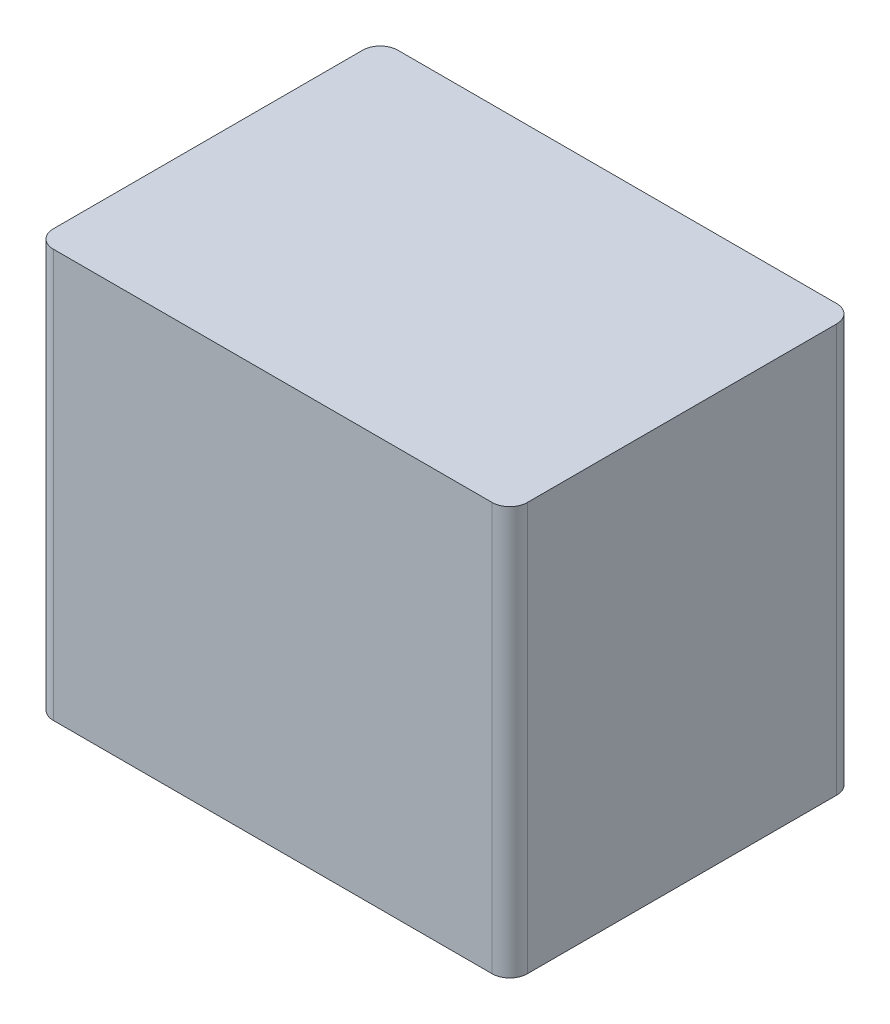
ISO-10303-21;
HEADER;
FILE_DESCRIPTION(('STEP AP214'),'2;1');
FILE_NAME('part.step','',(''),(''),'','','');
FILE_SCHEMA(('AUTOMOTIVE_DESIGN { 1 0 10303 214 1 1 1 1 }'));
ENDSEC;
DATA;
#1=APPLICATION_CONTEXT('core data for automotive mechanical design processes');
#2=APPLICATION_PROTOCOL_DEFINITION('international standard','automotive_design',2000,#1);
#3=PRODUCT_CONTEXT('',#1,'mechanical');
#4=PRODUCT('Part','Part','',(#3));
#5=PRODUCT_RELATED_PRODUCT_CATEGORY('part','',(#4));
#6=PRODUCT_DEFINITION_FORMATION('','',#4);
#7=PRODUCT_DEFINITION_CONTEXT('part definition',#1,'design');
#8=PRODUCT_DEFINITION('design','',#6,#7);
#9=PRODUCT_DEFINITION_SHAPE('','',#8);
#10=(LENGTH_UNIT() NAMED_UNIT(*) SI_UNIT(.MILLI.,.METRE.));
#11=(NAMED_UNIT(*) PLANE_ANGLE_UNIT() SI_UNIT($,.RADIAN.));
#12=(NAMED_UNIT(*) SI_UNIT($,.STERADIAN.) SOLID_ANGLE_UNIT());
#13=UNCERTAINTY_MEASURE_WITH_UNIT(LENGTH_MEASURE(1.E-05),#10,'distance_accuracy_value','');
#14=(GEOMETRIC_REPRESENTATION_CONTEXT(3) GLOBAL_UNCERTAINTY_ASSIGNED_CONTEXT((#13)) GLOBAL_UNIT_ASSIGNED_CONTEXT((#10,
#11,#12)) REPRESENTATION_CONTEXT('',''));
#15=CARTESIAN_POINT('',(0.,0.,0.));
#16=DIRECTION('',(0.,0.,1.));
#17=DIRECTION('',(1.,0.,0.));
#18=AXIS2_PLACEMENT_3D('',#15,#16,#17);
#19=CARTESIAN_POINT('',(5.00946119753698,-0.19001345520579,-25.5397553087484));
#20=DIRECTION('',(0.999961923064161,2.10614858886515E-12,-0.00872653549951581));
#21=DIRECTION('',(0.00872653549951581,0.,0.999961923064161));
#22=AXIS2_PLACEMENT_3D('',#19,#20,#21);
#23=PLANE('',#22);
#24=DIRECTION('',(-2.10606839318047E-12,1.,0.));
#25=VECTOR('',#24,1.);
#26=CARTESIAN_POINT('',(5.00946119753698,-0.19001345520579,-25.5397553087484));
#27=LINE('',#26,#25);
#28=CARTESIAN_POINT('',(5.00946119753658,0.,-25.5397553087484));
#29=VERTEX_POINT('',#28);
#30=CARTESIAN_POINT('',(5.00946119751593,9.80998654479421,-25.5397553087482));
#31=VERTEX_POINT('',#30);
#32=EDGE_CURVE('E357',#29,#31,#27,.T.);
#33=ORIENTED_EDGE('',*,*,#32,.T.);
#34=DIRECTION('',(-0.00872653549951581,0.,-0.999961923064161));
#35=VECTOR('',#34,1.);
#36=CARTESIAN_POINT('',(5.00946119751593,9.80998654479421,-25.5397553087482));
#37=LINE('',#36,#35);
#38=CARTESIAN_POINT('',(5.11417962351011,9.80998654479421,-13.5402122319783));
#39=VERTEX_POINT('',#38);
#40=EDGE_CURVE('E208',#39,#31,#37,.T.);
#41=ORIENTED_EDGE('',*,*,#40,.F.);
#42=DIRECTION('',(-2.10606839318047E-12,1.,0.));
#43=VECTOR('',#42,1.);
#44=CARTESIAN_POINT('',(5.11417962353117,-0.19001345520579,-13.5402122319785));
#45=LINE('',#44,#43);
#46=CARTESIAN_POINT('',(5.11417962353077,0.,-13.5402122319783));
#47=VERTEX_POINT('',#46);
#48=EDGE_CURVE('E355',#47,#39,#45,.T.);
#49=ORIENTED_EDGE('',*,*,#48,.F.);
#50=DIRECTION('',(0.00872653549951581,0.,0.999961923064161));
#51=VECTOR('',#50,1.);
#52=CARTESIAN_POINT('',(5.23194480994204,0.,-0.0456584906508857));
#53=LINE('',#52,#51);
#54=EDGE_CURVE('E427',#29,#47,#53,.T.);
#55=ORIENTED_EDGE('',*,*,#54,.F.);
#56=EDGE_LOOP('',(#33,#41,#49,#55));
#57=FACE_BOUND('',#56,.T.);
#58=ADVANCED_FACE('F33',(#57),#23,.T.);
#59=CARTESIAN_POINT('',(8.63605020586244,-0.190013455198152,-25.5714040715596));
#60=DIRECTION('',(0.00872653549951581,0.,0.999961923064161));
#61=DIRECTION('',(-0.999961923064161,-2.10614858886515E-12,0.00872653549951581));
#62=AXIS2_PLACEMENT_3D('',#59,#60,#61);
#63=PLANE('',#62);
#64=DIRECTION('',(-2.10606839318047E-12,1.,0.));
#65=VECTOR('',#64,1.);
#66=CARTESIAN_POINT('',(8.63605020586244,-0.190013455198152,-25.5714040715596));
#67=LINE('',#66,#65);
#68=CARTESIAN_POINT('',(8.63605020586202,0.,-25.5714040715594));
#69=VERTEX_POINT('',#68);
#70=CARTESIAN_POINT('',(8.63605020584139,9.80998654480185,-25.5714040715594));
#71=VERTEX_POINT('',#70);
#72=EDGE_CURVE('E214',#69,#71,#67,.T.);
#73=ORIENTED_EDGE('',*,*,#72,.T.);
#74=DIRECTION('',(0.999961923064161,2.10614858886515E-12,-0.00872653549951581));
#75=VECTOR('',#74,1.);
#76=CARTESIAN_POINT('',(8.63605020584139,9.80998654480185,-25.5714040715594));
#77=LINE('',#76,#75);
#78=EDGE_CURVE('E199',#31,#71,#77,.T.);
#79=ORIENTED_EDGE('',*,*,#78,.F.);
#80=ORIENTED_EDGE('',*,*,#32,.F.);
#81=DIRECTION('',(-0.999961923064161,0.,0.00872653549951581));
#82=VECTOR('',#81,1.);
#83=CARTESIAN_POINT('',(-0.222483612405456,0.,-25.4940968180975));
#84=LINE('',#83,#82);
#85=EDGE_CURVE('E217',#69,#29,#84,.T.);
#86=ORIENTED_EDGE('',*,*,#85,.F.);
#87=EDGE_LOOP('',(#73,#79,#80,#86));
#88=FACE_BOUND('',#87,.T.);
#89=ADVANCED_FACE('F215',(#88),#63,.T.);
#90=CARTESIAN_POINT('',(5.11417962353117,-0.19001345520579,-13.5402122319785));
#91=DIRECTION('',(-0.00872653549951581,0.,-0.999961923064161));
#92=DIRECTION('',(0.999961923064161,2.10614858886515E-12,-0.00872653549951581));
#93=AXIS2_PLACEMENT_3D('',#90,#91,#92);
#94=PLANE('',#93);
#95=ORIENTED_EDGE('',*,*,#48,.T.);
#96=DIRECTION('',(-0.999961923064161,-2.10614858886515E-12,0.00872653549951581));
#97=VECTOR('',#96,1.);
#98=CARTESIAN_POINT('',(5.11417962351011,9.80998654479421,-13.5402122319783));
#99=LINE('',#98,#97);
#100=CARTESIAN_POINT('',(8.74076863183557,9.80998654480185,-13.5718609947895));
#101=VERTEX_POINT('',#100);
#102=EDGE_CURVE('E360',#101,#39,#99,.T.);
#103=ORIENTED_EDGE('',*,*,#102,.F.);
#104=DIRECTION('',(-2.10606839318047E-12,1.,0.));
#105=VECTOR('',#104,1.);
#106=CARTESIAN_POINT('',(8.74076863185663,-0.190013455198152,-13.5718609947897));
#107=LINE('',#106,#105);
#108=CARTESIAN_POINT('',(8.74076863185663,0.,-13.5718609947897));
#109=VERTEX_POINT('',#108);
#110=EDGE_CURVE('E352',#109,#101,#107,.T.);
#111=ORIENTED_EDGE('',*,*,#110,.F.);
#112=DIRECTION('',(0.999961923064161,0.,-0.00872653549951581));
#113=VECTOR('',#112,1.);
#114=CARTESIAN_POINT('',(-0.117765186411266,0.,-13.4945537413276));
#115=LINE('',#114,#113);
#116=EDGE_CURVE('E425',#47,#109,#115,.T.);
#117=ORIENTED_EDGE('',*,*,#116,.F.);
#118=EDGE_LOOP('',(#95,#103,#111,#117));
#119=FACE_BOUND('',#118,.T.);
#120=ADVANCED_FACE('F258',(#119),#94,.T.);
#121=CARTESIAN_POINT('',(52.8798069033003,9.80998654489543,-47.2360374930659));
#122=DIRECTION('',(-2.10606839318047E-12,1.,0.));
#123=DIRECTION('',(-0.999961923064161,-2.10614858886515E-12,0.00872653549951581));
#124=AXIS2_PLACEMENT_3D('',#121,#122,#123);
#125=PLANE('',#124);
#126=CARTESIAN_POINT('',(22.407081720482,9.80998654483074,-19.6913535726313));
#127=DIRECTION('',(-2.10606839318047E-12,1.,0.));
#128=DIRECTION('',(-0.999961923064161,-2.10614858886515E-12,0.00872653549951581));
#129=AXIS2_PLACEMENT_3D('',#126,#127,#128);
#130=CIRCLE('',#129,2.5);
#131=CARTESIAN_POINT('',(19.9071769128216,9.80998654482548,-19.6695372338825));
#132=VERTEX_POINT('',#131);
#133=EDGE_CURVE('E37',#132,#132,#130,.T.);
#134=ORIENTED_EDGE('',*,*,#133,.T.);
#135=EDGE_LOOP('',(#134));
#136=FACE_BOUND('',#135,.T.);
#137=ORIENTED_EDGE('',*,*,#78,.T.);
#138=DIRECTION('',(0.105951749312924,2.41417558327085E-13,-0.994371272119992));
#139=VECTOR('',#138,1.);
#140=CARTESIAN_POINT('',(9.91590696668784,9.80998654480477,-37.5830301529329));
#141=LINE('',#140,#139);
#142=CARTESIAN_POINT('',(9.91590696668784,9.80998654480477,-37.5830301529329));
#143=VERTEX_POINT('',#142);
#144=EDGE_CURVE('E204',#71,#143,#141,.T.);
#145=ORIENTED_EDGE('',*,*,#144,.T.);
#146=DIRECTION('',(0.999961923064161,2.10614858886515E-12,-0.00872653549951588));
#147=VECTOR('',#146,1.);
#148=CARTESIAN_POINT('',(33.4536851429787,9.80998654485434,-37.7884412311925));
#149=LINE('',#148,#147);
#150=CARTESIAN_POINT('',(33.4536851429787,9.80998654485434,-37.7884412311925));
#151=VERTEX_POINT('',#150);
#152=EDGE_CURVE('E225',#143,#151,#149,.T.);
#153=ORIENTED_EDGE('',*,*,#152,.T.);
#154=DIRECTION('',(0.00872653549951499,0.,0.999961923064161));
#155=VECTOR('',#154,1.);
#156=CARTESIAN_POINT('',(33.4907729188517,9.80998654485434,-33.5386030581698));
#157=LINE('',#156,#155);
#158=CARTESIAN_POINT('',(33.4907729188517,9.80998654485434,-33.5386030581698));
#159=VERTEX_POINT('',#158);
#160=EDGE_CURVE('E227',#151,#159,#157,.T.);
#161=ORIENTED_EDGE('',*,*,#160,.T.);
#162=DIRECTION('',(-0.999961923064161,-2.10614858886515E-12,0.00872653549951567));
#163=VECTOR('',#162,1.);
#164=CARTESIAN_POINT('',(21.4912298420817,9.80998654482907,-33.4338846321756));
#165=LINE('',#164,#163);
#166=CARTESIAN_POINT('',(21.4912298420817,9.80998654482907,-33.4338846321756));
#167=VERTEX_POINT('',#166);
#168=EDGE_CURVE('E389',#159,#167,#165,.T.);
#169=ORIENTED_EDGE('',*,*,#168,.T.);
#170=DIRECTION('',(0.00872653549951651,0.,0.999961923064161));
#171=VECTOR('',#170,1.);
#172=CARTESIAN_POINT('',(21.5784951970769,9.80998654482907,-23.434265401534));
#173=LINE('',#172,#171);
#174=CARTESIAN_POINT('',(21.5784951970769,9.80998654482907,-23.434265401534));
#175=VERTEX_POINT('',#174);
#176=EDGE_CURVE('E386',#167,#175,#173,.T.);
#177=ORIENTED_EDGE('',*,*,#176,.T.);
#178=DIRECTION('',(0.999111263362466,2.10342194887089E-12,0.0421507226777697));
#179=VECTOR('',#178,1.);
#180=CARTESIAN_POINT('',(51.0404341665905,9.80998654489109,-22.1913187302353));
#181=LINE('',#180,#179);
#182=CARTESIAN_POINT('',(51.0404341665905,9.80998654489109,-22.1913187302353));
#183=VERTEX_POINT('',#182);
#184=EDGE_CURVE('E383',#175,#183,#181,.T.);
#185=ORIENTED_EDGE('',*,*,#184,.T.);
#186=DIRECTION('',(0.00872653549951571,0.,0.999961923064161));
#187=VECTOR('',#186,1.);
#188=CARTESIAN_POINT('',(51.0797035763383,9.80998654489109,-17.6914900764466));
#189=LINE('',#188,#187);
#190=CARTESIAN_POINT('',(51.0797035763383,9.80998654489109,-17.6914900764466));
#191=VERTEX_POINT('',#190);
#192=EDGE_CURVE('E380',#183,#191,#189,.T.);
#193=ORIENTED_EDGE('',*,*,#192,.T.);
#194=DIRECTION('',(-0.998223462333818,-2.10342194887089E-12,0.0595811987650935));
#195=VECTOR('',#194,1.);
#196=CARTESIAN_POINT('',(21.6439442133232,9.80998654482907,-15.9345509785527));
#197=LINE('',#196,#195);
#198=CARTESIAN_POINT('',(21.6439442133232,9.80998654482907,-15.9345509785527));
#199=VERTEX_POINT('',#198);
#200=EDGE_CURVE('E377',#191,#199,#197,.T.);
#201=ORIENTED_EDGE('',*,*,#200,.T.);
#202=DIRECTION('',(0.00872653549951581,0.,0.999961923064161));
#203=VECTOR('',#202,1.);
#204=CARTESIAN_POINT('',(21.7312095683184,9.80998654482907,-5.93493174791113));
#205=LINE('',#204,#203);
#206=CARTESIAN_POINT('',(21.7312095683184,9.80998654482907,-5.93493174791113));
#207=VERTEX_POINT('',#206);
#208=EDGE_CURVE('E374',#199,#207,#205,.T.);
#209=ORIENTED_EDGE('',*,*,#208,.T.);
#210=DIRECTION('',(0.999961923064161,2.10614858886515E-12,-0.00872653549951639));
#211=VECTOR('',#210,1.);
#212=CARTESIAN_POINT('',(33.7307526450883,9.80998654485434,-6.03965017390532));
#213=LINE('',#212,#211);
#214=CARTESIAN_POINT('',(33.7307526450883,9.80998654485434,-6.03965017390532));
#215=VERTEX_POINT('',#214);
#216=EDGE_CURVE('E371',#207,#215,#213,.T.);
#217=ORIENTED_EDGE('',*,*,#216,.T.);
#218=DIRECTION('',(0.00872653549951499,0.,0.999961923064161));
#219=VECTOR('',#218,1.);
#220=CARTESIAN_POINT('',(33.7678404209613,9.80998654485434,-1.78981200088264));
#221=LINE('',#220,#219);
#222=CARTESIAN_POINT('',(33.7678404209613,9.80998654485434,-1.78981200088264));
#223=VERTEX_POINT('',#222);
#224=EDGE_CURVE('E368',#215,#223,#221,.T.);
#225=ORIENTED_EDGE('',*,*,#224,.T.);
#226=DIRECTION('',(-0.999961923064161,-2.10614858886515E-12,0.00872653549951522));
#227=VECTOR('',#226,1.);
#228=CARTESIAN_POINT('',(10.2300622446704,9.80998654480477,-1.58440092262307));
#229=LINE('',#228,#227);
#230=CARTESIAN_POINT('',(10.2300622446704,9.80998654480477,-1.58440092262307));
#231=VERTEX_POINT('',#230);
#232=EDGE_CURVE('E365',#223,#231,#229,.T.);
#233=ORIENTED_EDGE('',*,*,#232,.T.);
#234=DIRECTION('',(-0.123289783941176,-2.4141755832708E-13,-0.992370711566871));
#235=VECTOR('',#234,1.);
#236=CARTESIAN_POINT('',(8.74076863183557,9.80998654480185,-13.5718609947895));
#237=LINE('',#236,#235);
#238=EDGE_CURVE('E362',#231,#101,#237,.T.);
#239=ORIENTED_EDGE('',*,*,#238,.T.);
#240=ORIENTED_EDGE('',*,*,#102,.T.);
#241=ORIENTED_EDGE('',*,*,#40,.T.);
#242=EDGE_LOOP('',(#137,#145,#153,#161,#169,#177,#185,#193,#201,#209,#217,#225,#233,#239,#240,#241));
#243=FACE_BOUND('',#242,.T.);
#244=ADVANCED_FACE('F201',(#136,#243),#125,.F.);
#245=CARTESIAN_POINT('',(8.74076863185663,-0.190013455198152,-13.5718609947897));
#246=DIRECTION('',(0.992370711566871,2.09226657979094E-12,-0.123289783941176));
#247=DIRECTION('',(0.123289783941176,2.4141755832708E-13,0.992370711566871));
#248=AXIS2_PLACEMENT_3D('',#245,#246,#247);
#249=PLANE('',#248);
#250=ORIENTED_EDGE('',*,*,#110,.T.);
#251=ORIENTED_EDGE('',*,*,#238,.F.);
#252=DIRECTION('',(-2.10606839318047E-12,1.,0.));
#253=VECTOR('',#252,1.);
#254=CARTESIAN_POINT('',(10.2300622446914,-0.190013455195236,-1.58440092262326));
#255=LINE('',#254,#253);
#256=CARTESIAN_POINT('',(10.2300622446911,0.,-1.58440092262307));
#257=VERTEX_POINT('',#256);
#258=EDGE_CURVE('E349',#257,#231,#255,.T.);
#259=ORIENTED_EDGE('',*,*,#258,.F.);
#260=DIRECTION('',(0.123289783941176,0.,0.992370711566871));
#261=VECTOR('',#260,1.);
#262=CARTESIAN_POINT('',(10.2684116438268,0.,-1.27572311257309));
#263=LINE('',#262,#261);
#264=EDGE_CURVE('E422',#109,#257,#263,.T.);
#265=ORIENTED_EDGE('',*,*,#264,.F.);
#266=EDGE_LOOP('',(#250,#251,#259,#265));
#267=FACE_BOUND('',#266,.T.);
#268=ADVANCED_FACE('F265',(#267),#249,.T.);
#269=CARTESIAN_POINT('',(10.2300622446914,-0.190013455195236,-1.58440092262326));
#270=DIRECTION('',(-0.00872653549951522,0.,-0.999961923064161));
#271=DIRECTION('',(0.999961923064161,2.10614858886515E-12,-0.00872653549951522));
#272=AXIS2_PLACEMENT_3D('',#269,#270,#271);
#273=PLANE('',#272);
#274=ORIENTED_EDGE('',*,*,#258,.T.);
#275=ORIENTED_EDGE('',*,*,#232,.F.);
#276=DIRECTION('',(-2.10606839318047E-12,1.,0.));
#277=VECTOR('',#276,1.);
#278=CARTESIAN_POINT('',(33.7678404209823,-0.190013455145659,-1.78981200088282));
#279=LINE('',#278,#277);
#280=CARTESIAN_POINT('',(33.7678404209823,0.,-1.78981200088282));
#281=VERTEX_POINT('',#280);
#282=EDGE_CURVE('E346',#281,#223,#279,.T.);
#283=ORIENTED_EDGE('',*,*,#282,.F.);
#284=DIRECTION('',(0.999961923064161,0.,-0.00872653549951522));
#285=VECTOR('',#284,1.);
#286=CARTESIAN_POINT('',(-0.0130467604170755,0.,-1.49501066455765));
#287=LINE('',#286,#285);
#288=EDGE_CURVE('E420',#257,#281,#287,.T.);
#289=ORIENTED_EDGE('',*,*,#288,.F.);
#290=EDGE_LOOP('',(#274,#275,#283,#289));
#291=FACE_BOUND('',#290,.T.);
#292=ADVANCED_FACE('F268',(#291),#273,.T.);
#293=CARTESIAN_POINT('',(33.7678404209823,-0.190013455145659,-1.78981200088282));
#294=DIRECTION('',(-0.999961923064161,-2.10614858886515E-12,0.00872653549951499));
#295=DIRECTION('',(-0.00872653549951499,0.,-0.999961923064161));
#296=AXIS2_PLACEMENT_3D('',#293,#294,#295);
#297=PLANE('',#296);
#298=ORIENTED_EDGE('',*,*,#282,.T.);
#299=ORIENTED_EDGE('',*,*,#224,.F.);
#300=DIRECTION('',(-2.10606839318047E-12,1.,0.));
#301=VECTOR('',#300,1.);
#302=CARTESIAN_POINT('',(33.7307526451094,-0.190013455145659,-6.03965017390551));
#303=LINE('',#302,#301);
#304=CARTESIAN_POINT('',(33.730752645109,0.,-6.03965017390551));
#305=VERTEX_POINT('',#304);
#306=EDGE_CURVE('E343',#305,#215,#303,.T.);
#307=ORIENTED_EDGE('',*,*,#306,.F.);
#308=DIRECTION('',(-0.00872653549951499,0.,-0.999961923064161));
#309=VECTOR('',#308,1.);
#310=CARTESIAN_POINT('',(33.780887181399,0.,-0.294801336325158));
#311=LINE('',#310,#309);
#312=EDGE_CURVE('E416',#281,#305,#311,.T.);
#313=ORIENTED_EDGE('',*,*,#312,.F.);
#314=EDGE_LOOP('',(#298,#299,#307,#313));
#315=FACE_BOUND('',#314,.T.);
#316=ADVANCED_FACE('F272',(#315),#297,.T.);
#317=CARTESIAN_POINT('',(33.7307526451094,-0.190013455145659,-6.03965017390551));
#318=DIRECTION('',(0.00872653549951639,0.,0.999961923064161));
#319=DIRECTION('',(-0.999961923064161,-2.10614858886515E-12,0.00872653549951639));
#320=AXIS2_PLACEMENT_3D('',#317,#318,#319);
#321=PLANE('',#320);
#322=ORIENTED_EDGE('',*,*,#306,.T.);
#323=ORIENTED_EDGE('',*,*,#216,.F.);
#324=DIRECTION('',(-2.10606839318047E-12,1.,0.));
#325=VECTOR('',#324,1.);
#326=CARTESIAN_POINT('',(21.7312095683394,-0.190013455170932,-5.93493174791131));
#327=LINE('',#326,#325);
#328=CARTESIAN_POINT('',(21.7312095683184,0.,-5.93493174791112));
#329=VERTEX_POINT('',#328);
#330=EDGE_CURVE('E340',#329,#207,#327,.T.);
#331=ORIENTED_EDGE('',*,*,#330,.F.);
#332=DIRECTION('',(-0.999961923064161,0.,0.00872653549951639));
#333=VECTOR('',#332,1.);
#334=CARTESIAN_POINT('',(-0.0501345362900215,0.,-5.7448488375803));
#335=LINE('',#334,#333);
#336=EDGE_CURVE('E413',#305,#329,#335,.T.);
#337=ORIENTED_EDGE('',*,*,#336,.F.);
#338=EDGE_LOOP('',(#322,#323,#331,#337));
#339=FACE_BOUND('',#338,.T.);
#340=ADVANCED_FACE('F276',(#339),#321,.T.);
#341=CARTESIAN_POINT('',(21.7312095683394,-0.190013455170932,-5.93493174791131));
#342=DIRECTION('',(-0.999961923064161,-2.10614858886515E-12,0.00872653549951581));
#343=DIRECTION('',(-0.00872653549951581,0.,-0.999961923064161));
#344=AXIS2_PLACEMENT_3D('',#341,#342,#343);
#345=PLANE('',#344);
#346=ORIENTED_EDGE('',*,*,#330,.T.);
#347=ORIENTED_EDGE('',*,*,#208,.F.);
#348=DIRECTION('',(-2.10606839318047E-12,1.,0.));
#349=VECTOR('',#348,1.);
#350=CARTESIAN_POINT('',(21.6439442133443,-0.190013455170932,-15.9345509785529));
#351=LINE('',#350,#349);
#352=CARTESIAN_POINT('',(21.6439442133439,0.,-15.9345509785529));
#353=VERTEX_POINT('',#352);
#354=EDGE_CURVE('E337',#353,#199,#351,.T.);
#355=ORIENTED_EDGE('',*,*,#354,.F.);
#356=DIRECTION('',(-0.00872653549951581,0.,-0.999961923064161));
#357=VECTOR('',#356,1.);
#358=CARTESIAN_POINT('',(21.7813441046291,0.,-0.190082910330996));
#359=LINE('',#358,#357);
#360=EDGE_CURVE('E411',#329,#353,#359,.T.);
#361=ORIENTED_EDGE('',*,*,#360,.F.);
#362=EDGE_LOOP('',(#346,#347,#355,#361));
#363=FACE_BOUND('',#362,.T.);
#364=ADVANCED_FACE('F280',(#363),#345,.T.);
#365=CARTESIAN_POINT('',(21.6439442133443,-0.190013455170932,-15.9345509785529));
#366=DIRECTION('',(-0.0595811987650935,-1.07135350780591E-13,-0.998223462333818));
#367=DIRECTION('',(0.998223462333818,2.10342194887089E-12,-0.0595811987650935));
#368=AXIS2_PLACEMENT_3D('',#365,#366,#367);
#369=PLANE('',#368);
#370=ORIENTED_EDGE('',*,*,#354,.T.);
#371=ORIENTED_EDGE('',*,*,#200,.F.);
#372=DIRECTION('',(-2.10606839318047E-12,1.,0.));
#373=VECTOR('',#372,1.);
#374=CARTESIAN_POINT('',(51.0797035763594,-0.190013455108907,-17.6914900764468));
#375=LINE('',#374,#373);
#376=CARTESIAN_POINT('',(51.0797035763594,0.,-17.6914900764468));
#377=VERTEX_POINT('',#376);
#378=EDGE_CURVE('E334',#377,#191,#375,.T.);
#379=ORIENTED_EDGE('',*,*,#378,.F.);
#380=DIRECTION('',(0.998223462333818,0.,-0.0595811987650935));
#381=VECTOR('',#380,1.);
#382=CARTESIAN_POINT('',(-0.870878750720335,0.,-14.5907034406013));
#383=LINE('',#382,#381);
#384=EDGE_CURVE('E407',#353,#377,#383,.T.);
#385=ORIENTED_EDGE('',*,*,#384,.F.);
#386=EDGE_LOOP('',(#370,#371,#379,#385));
#387=FACE_BOUND('',#386,.T.);
#388=ADVANCED_FACE('F284',(#387),#369,.T.);
#389=CARTESIAN_POINT('',(51.0797035763594,-0.190013455108907,-17.6914900764468));
#390=DIRECTION('',(-0.999961923064161,-2.10614858886515E-12,0.00872653549951571));
#391=DIRECTION('',(-0.00872653549951571,0.,-0.999961923064161));
#392=AXIS2_PLACEMENT_3D('',#389,#390,#391);
#393=PLANE('',#392);
#394=ORIENTED_EDGE('',*,*,#378,.T.);
#395=ORIENTED_EDGE('',*,*,#192,.F.);
#396=DIRECTION('',(-2.10606839318047E-12,1.,0.));
#397=VECTOR('',#396,1.);
#398=CARTESIAN_POINT('',(51.0404341666116,-0.190013455108907,-22.1913187302355));
#399=LINE('',#398,#397);
#400=CARTESIAN_POINT('',(51.0404341666112,0.,-22.1913187302355));
#401=VERTEX_POINT('',#400);
#402=EDGE_CURVE('E331',#401,#183,#399,.T.);
#403=ORIENTED_EDGE('',*,*,#402,.F.);
#404=DIRECTION('',(-0.00872653549951571,0.,-0.999961923064161));
#405=VECTOR('',#404,1.);
#406=CARTESIAN_POINT('',(51.2301932708935,0.,-0.447079123628608));
#407=LINE('',#406,#405);
#408=EDGE_CURVE('E404',#377,#401,#407,.T.);
#409=ORIENTED_EDGE('',*,*,#408,.F.);
#410=EDGE_LOOP('',(#394,#395,#403,#409));
#411=FACE_BOUND('',#410,.T.);
#412=ADVANCED_FACE('F288',(#411),#393,.T.);
#413=CARTESIAN_POINT('',(51.0404341666116,-0.190013455108907,-22.1913187302355));
#414=DIRECTION('',(-0.0421507226777697,-1.07135350780591E-13,0.999111263362466));
#415=DIRECTION('',(-0.999111263362466,-2.10342194887089E-12,-0.0421507226777697));
#416=AXIS2_PLACEMENT_3D('',#413,#414,#415);
#417=PLANE('',#416);
#418=ORIENTED_EDGE('',*,*,#402,.T.);
#419=ORIENTED_EDGE('',*,*,#184,.F.);
#420=DIRECTION('',(-2.10606839318047E-12,1.,0.));
#421=VECTOR('',#420,1.);
#422=CARTESIAN_POINT('',(21.578495197098,-0.190013455170932,-23.4342654015342));
#423=LINE('',#422,#421);
#424=CARTESIAN_POINT('',(21.5784951970769,0.,-23.434265401535));
#425=VERTEX_POINT('',#424);
#426=EDGE_CURVE('E328',#425,#175,#423,.T.);
#427=ORIENTED_EDGE('',*,*,#426,.F.);
#428=DIRECTION('',(-0.999111263362465,0.,-0.0421507226777697));
#429=VECTOR('',#428,1.);
#430=CARTESIAN_POINT('',(1.0252315083167,0.,-24.3013709478707));
#431=LINE('',#430,#429);
#432=EDGE_CURVE('E402',#401,#425,#431,.T.);
#433=ORIENTED_EDGE('',*,*,#432,.F.);
#434=EDGE_LOOP('',(#418,#419,#427,#433));
#435=FACE_BOUND('',#434,.T.);
#436=ADVANCED_FACE('F292',(#435),#417,.T.);
#437=CARTESIAN_POINT('',(21.578495197098,-0.190013455170932,-23.4342654015342));
#438=DIRECTION('',(-0.999961923064161,-2.10614858886515E-12,0.00872653549951651));
#439=DIRECTION('',(-0.00872653549951651,0.,-0.999961923064161));
#440=AXIS2_PLACEMENT_3D('',#437,#438,#439);
#441=PLANE('',#440);
#442=ORIENTED_EDGE('',*,*,#426,.T.);
#443=ORIENTED_EDGE('',*,*,#176,.F.);
#444=DIRECTION('',(-2.10606839318047E-12,1.,0.));
#445=VECTOR('',#444,1.);
#446=CARTESIAN_POINT('',(21.4912298421028,-0.190013455170932,-33.4338846321758));
#447=LINE('',#446,#445);
#448=CARTESIAN_POINT('',(21.4912298421024,0.,-33.4338846321758));
#449=VERTEX_POINT('',#448);
#450=EDGE_CURVE('E323',#449,#167,#447,.T.);
#451=ORIENTED_EDGE('',*,*,#450,.F.);
#452=DIRECTION('',(-0.00872653549951651,0.,-0.999961923064161));
#453=VECTOR('',#452,1.);
#454=CARTESIAN_POINT('',(21.7813441046291,0.,-0.190082910331011));
#455=LINE('',#454,#453);
#456=EDGE_CURVE('E398',#425,#449,#455,.T.);
#457=ORIENTED_EDGE('',*,*,#456,.F.);
#458=EDGE_LOOP('',(#442,#443,#451,#457));
#459=FACE_BOUND('',#458,.T.);
#460=ADVANCED_FACE('F296',(#459),#441,.T.);
#461=CARTESIAN_POINT('',(21.4912298421028,-0.190013455170932,-33.4338846321758));
#462=DIRECTION('',(-0.00872653549951567,0.,-0.999961923064161));
#463=DIRECTION('',(0.999961923064161,2.10614858886515E-12,-0.00872653549951567));
#464=AXIS2_PLACEMENT_3D('',#461,#462,#463);
#465=PLANE('',#464);
#466=ORIENTED_EDGE('',*,*,#450,.T.);
#467=ORIENTED_EDGE('',*,*,#168,.F.);
#468=DIRECTION('',(-2.10606839318047E-12,1.,0.));
#469=VECTOR('',#468,1.);
#470=CARTESIAN_POINT('',(33.4907729188727,-0.190013455145659,-33.5386030581699));
#471=LINE('',#470,#469);
#472=CARTESIAN_POINT('',(33.4907729188727,0.,-33.53860305817));
#473=VERTEX_POINT('',#472);
#474=EDGE_CURVE('E319',#473,#159,#471,.T.);
#475=ORIENTED_EDGE('',*,*,#474,.F.);
#476=DIRECTION('',(0.999961923064161,0.,-0.00872653549951567));
#477=VECTOR('',#476,1.);
#478=CARTESIAN_POINT('',(-0.290114262526699,0.,-33.2438017218448));
#479=LINE('',#478,#477);
#480=EDGE_CURVE('E395',#449,#473,#479,.T.);
#481=ORIENTED_EDGE('',*,*,#480,.F.);
#482=EDGE_LOOP('',(#466,#467,#475,#481));
#483=FACE_BOUND('',#482,.T.);
#484=ADVANCED_FACE('F300',(#483),#465,.T.);
#485=CARTESIAN_POINT('',(33.4907729188727,-0.190013455145659,-33.5386030581699));
#486=DIRECTION('',(-0.999961923064161,-2.10614858886515E-12,0.00872653549951499));
#487=DIRECTION('',(-0.00872653549951499,0.,-0.999961923064161));
#488=AXIS2_PLACEMENT_3D('',#485,#486,#487);
#489=PLANE('',#488);
#490=ORIENTED_EDGE('',*,*,#474,.T.);
#491=ORIENTED_EDGE('',*,*,#160,.F.);
#492=DIRECTION('',(-2.10606839318047E-12,1.,0.));
#493=VECTOR('',#492,1.);
#494=CARTESIAN_POINT('',(33.4536851429998,-0.190013455145659,-37.7884412311926));
#495=LINE('',#494,#493);
#496=CARTESIAN_POINT('',(33.4536851429994,0.,-37.7884412311926));
#497=VERTEX_POINT('',#496);
#498=EDGE_CURVE('E316',#497,#151,#495,.T.);
#499=ORIENTED_EDGE('',*,*,#498,.F.);
#500=DIRECTION('',(-0.00872653549951499,0.,-0.999961923064161));
#501=VECTOR('',#500,1.);
#502=CARTESIAN_POINT('',(33.780887181399,0.,-0.294801336325158));
#503=LINE('',#502,#501);
#504=EDGE_CURVE('E393',#473,#497,#503,.T.);
#505=ORIENTED_EDGE('',*,*,#504,.F.);
#506=EDGE_LOOP('',(#490,#491,#499,#505));
#507=FACE_BOUND('',#506,.T.);
#508=ADVANCED_FACE('F304',(#507),#489,.T.);
#509=CARTESIAN_POINT('',(33.4536851429998,-0.190013455145659,-37.7884412311926));
#510=DIRECTION('',(0.00872653549951588,0.,0.999961923064161));
#511=DIRECTION('',(-0.999961923064161,-2.10614858886515E-12,0.00872653549951588));
#512=AXIS2_PLACEMENT_3D('',#509,#510,#511);
#513=PLANE('',#512);
#514=ORIENTED_EDGE('',*,*,#498,.T.);
#515=ORIENTED_EDGE('',*,*,#152,.F.);
#516=DIRECTION('',(-2.10606839318047E-12,1.,0.));
#517=VECTOR('',#516,1.);
#518=CARTESIAN_POINT('',(9.9159069667089,-0.190013455195236,-37.5830301529331));
#519=LINE('',#518,#517);
#520=CARTESIAN_POINT('',(9.91590696668784,0.,-37.5830301529329));
#521=VERTEX_POINT('',#520);
#522=EDGE_CURVE('E221',#521,#143,#519,.T.);
#523=ORIENTED_EDGE('',*,*,#522,.F.);
#524=DIRECTION('',(-0.999961923064161,0.,0.00872653549951588));
#525=VECTOR('',#524,1.);
#526=CARTESIAN_POINT('',(-0.327202038399648,0.,-37.4936398948675));
#527=LINE('',#526,#525);
#528=EDGE_CURVE('E317',#497,#521,#527,.T.);
#529=ORIENTED_EDGE('',*,*,#528,.F.);
#530=EDGE_LOOP('',(#514,#515,#523,#529));
#531=FACE_BOUND('',#530,.T.);
#532=ADVANCED_FACE('F248',(#531),#513,.T.);
#533=CARTESIAN_POINT('',(9.9159069667089,-0.190013455195236,-37.5830301529331));
#534=DIRECTION('',(0.994371272119992,2.09226657979094E-12,0.105951749312924));
#535=DIRECTION('',(-0.105951749312924,-2.41417558327085E-13,0.994371272119992));
#536=AXIS2_PLACEMENT_3D('',#533,#534,#535);
#537=PLANE('',#536);
#538=ORIENTED_EDGE('',*,*,#522,.T.);
#539=ORIENTED_EDGE('',*,*,#144,.F.);
#540=ORIENTED_EDGE('',*,*,#72,.F.);
#541=DIRECTION('',(-0.105951749312924,0.,0.994371272119992));
#542=VECTOR('',#541,1.);
#543=CARTESIAN_POINT('',(5.84501898070495,0.,0.622795532349415));
#544=LINE('',#543,#542);
#545=EDGE_CURVE('E431',#521,#69,#544,.T.);
#546=ORIENTED_EDGE('',*,*,#545,.F.);
#547=EDGE_LOOP('',(#538,#539,#540,#546));
#548=FACE_BOUND('',#547,.T.);
#549=ADVANCED_FACE('F223',(#548),#537,.T.);
#550=CARTESIAN_POINT('',(22.4070817204715,14.8099865448307,-19.6913535726312));
#551=DIRECTION('',(2.10606839318047E-12,-1.,0.));
#552=DIRECTION('',(0.999961923064161,2.10614858886515E-12,-0.00872653549951581));
#553=AXIS2_PLACEMENT_3D('',#550,#551,#552);
#554=CYLINDRICAL_SURFACE('',#553,2.5);
#555=CARTESIAN_POINT('',(22.4070817204715,14.8099865448307,-19.6913535726312));
#556=DIRECTION('',(-2.10606839318047E-12,1.,0.));
#557=DIRECTION('',(-0.999961923064161,-2.10614858886515E-12,0.00872653549951581));
#558=AXIS2_PLACEMENT_3D('',#555,#556,#557);
#559=CIRCLE('',#558,2.5);
#560=CARTESIAN_POINT('',(19.9071769128111,14.8099865448255,-19.6695372338824));
#561=VERTEX_POINT('',#560);
#562=EDGE_CURVE('E211',#561,#561,#559,.T.);
#563=ORIENTED_EDGE('',*,*,#562,.T.);
#564=EDGE_LOOP('',(#563));
#565=FACE_BOUND('',#564,.T.);
#566=ORIENTED_EDGE('',*,*,#133,.F.);
#567=EDGE_LOOP('',(#566));
#568=FACE_BOUND('',#567,.T.);
#569=ADVANCED_FACE('F237',(#565,#568),#554,.F.);
#570=CARTESIAN_POINT('',(22.4070817204715,14.8099865448307,-19.6913535726312));
#571=DIRECTION('',(-2.10606839318047E-12,1.,0.));
#572=DIRECTION('',(-0.999961923064161,-2.10614858886515E-12,0.00872653549951581));
#573=AXIS2_PLACEMENT_3D('',#570,#571,#572);
#574=PLANE('',#573);
#575=ORIENTED_EDGE('',*,*,#562,.F.);
#576=EDGE_LOOP('',(#575));
#577=FACE_BOUND('',#576,.T.);
#578=ADVANCED_FACE('F239',(#577),#574,.F.);
#579=CARTESIAN_POINT('',(0.,46.5,0.));
#580=DIRECTION('',(0.,-1.,0.));
#581=DIRECTION('',(0.,0.,-1.));
#582=AXIS2_PLACEMENT_3D('',#579,#580,#581);
#583=PLANE('',#582);
#584=DIRECTION('',(0.,0.,-1.));
#585=VECTOR('',#584,1.);
#586=CARTESIAN_POINT('',(54.,46.5,0.));
#587=LINE('',#586,#585);
#588=CARTESIAN_POINT('',(54.,46.5,-2.));
#589=VERTEX_POINT('',#588);
#590=CARTESIAN_POINT('',(54.,46.5,-37.25));
#591=VERTEX_POINT('',#590);
#592=EDGE_CURVE('E453',#589,#591,#587,.T.);
#593=ORIENTED_EDGE('',*,*,#592,.T.);
#594=CARTESIAN_POINT('',(52.,46.5,-37.25));
#595=DIRECTION('',(0.,-1.,0.));
#596=DIRECTION('',(0.,0.,-1.));
#597=AXIS2_PLACEMENT_3D('',#594,#595,#596);
#598=CIRCLE('',#597,2.);
#599=CARTESIAN_POINT('',(52.,46.5,-39.25));
#600=VERTEX_POINT('',#599);
#601=EDGE_CURVE('E493',#591,#600,#598,.F.);
#602=ORIENTED_EDGE('',*,*,#601,.T.);
#603=DIRECTION('',(-1.,0.,0.));
#604=VECTOR('',#603,1.);
#605=CARTESIAN_POINT('',(0.,46.5,-39.25));
#606=LINE('',#605,#604);
#607=CARTESIAN_POINT('',(2.,46.5,-39.25));
#608=VERTEX_POINT('',#607);
#609=EDGE_CURVE('E456',#600,#608,#606,.T.);
#610=ORIENTED_EDGE('',*,*,#609,.T.);
#611=CARTESIAN_POINT('',(2.,46.5,-37.25));
#612=DIRECTION('',(0.,-1.,0.));
#613=DIRECTION('',(0.,0.,-1.));
#614=AXIS2_PLACEMENT_3D('',#611,#612,#613);
#615=CIRCLE('',#614,2.);
#616=CARTESIAN_POINT('',(0.,46.5,-37.25));
#617=VERTEX_POINT('',#616);
#618=EDGE_CURVE('E489',#608,#617,#615,.F.);
#619=ORIENTED_EDGE('',*,*,#618,.T.);
#620=DIRECTION('',(0.,0.,1.));
#621=VECTOR('',#620,1.);
#622=CARTESIAN_POINT('',(0.,46.5,0.));
#623=LINE('',#622,#621);
#624=CARTESIAN_POINT('',(0.,46.5,-2.));
#625=VERTEX_POINT('',#624);
#626=EDGE_CURVE('E448',#617,#625,#623,.T.);
#627=ORIENTED_EDGE('',*,*,#626,.T.);
#628=CARTESIAN_POINT('',(2.,46.5,-2.));
#629=DIRECTION('',(0.,-1.,0.));
#630=DIRECTION('',(0.,0.,-1.));
#631=AXIS2_PLACEMENT_3D('',#628,#629,#630);
#632=CIRCLE('',#631,2.);
#633=CARTESIAN_POINT('',(2.,46.5,0.));
#634=VERTEX_POINT('',#633);
#635=EDGE_CURVE('E58',#625,#634,#632,.F.);
#636=ORIENTED_EDGE('',*,*,#635,.T.);
#637=DIRECTION('',(1.,0.,0.));
#638=VECTOR('',#637,1.);
#639=CARTESIAN_POINT('',(0.,46.5,0.));
#640=LINE('',#639,#638);
#641=CARTESIAN_POINT('',(52.,46.5,0.));
#642=VERTEX_POINT('',#641);
#643=EDGE_CURVE('E451',#634,#642,#640,.T.);
#644=ORIENTED_EDGE('',*,*,#643,.T.);
#645=CARTESIAN_POINT('',(52.,46.5,-2.));
#646=DIRECTION('',(0.,-1.,0.));
#647=DIRECTION('',(0.,0.,-1.));
#648=AXIS2_PLACEMENT_3D('',#645,#646,#647);
#649=CIRCLE('',#648,2.);
#650=EDGE_CURVE('E491',#642,#589,#649,.F.);
#651=ORIENTED_EDGE('',*,*,#650,.T.);
#652=EDGE_LOOP('',(#593,#602,#610,#619,#627,#636,#644,#651));
#653=FACE_BOUND('',#652,.T.);
#654=ADVANCED_FACE('F245',(#653),#583,.F.);
#655=CARTESIAN_POINT('',(2.,46.5,-37.25));
#656=DIRECTION('',(0.,-1.,0.));
#657=DIRECTION('',(0.,0.,-1.));
#658=AXIS2_PLACEMENT_3D('',#655,#656,#657);
#659=CYLINDRICAL_SURFACE('',#658,2.);
#660=ORIENTED_EDGE('',*,*,#618,.F.);
#661=DIRECTION('',(0.,-1.,0.));
#662=VECTOR('',#661,1.);
#663=CARTESIAN_POINT('',(2.,46.5,-39.25));
#664=LINE('',#663,#662);
#665=CARTESIAN_POINT('',(2.,0.,-39.25));
#666=VERTEX_POINT('',#665);
#667=EDGE_CURVE('E473',#666,#608,#664,.F.);
#668=ORIENTED_EDGE('',*,*,#667,.F.);
#669=CARTESIAN_POINT('',(2.,0.,-37.25));
#670=DIRECTION('',(0.,-1.,0.));
#671=DIRECTION('',(0.,0.,-1.));
#672=AXIS2_PLACEMENT_3D('',#669,#670,#671);
#673=CIRCLE('',#672,2.);
#674=CARTESIAN_POINT('',(0.,0.,-37.25));
#675=VERTEX_POINT('',#674);
#676=EDGE_CURVE('E478',#675,#666,#673,.T.);
#677=ORIENTED_EDGE('',*,*,#676,.F.);
#678=DIRECTION('',(0.,-1.,0.));
#679=VECTOR('',#678,1.);
#680=CARTESIAN_POINT('',(0.,46.5,-37.25));
#681=LINE('',#680,#679);
#682=EDGE_CURVE('E429',#617,#675,#681,.T.);
#683=ORIENTED_EDGE('',*,*,#682,.F.);
#684=EDGE_LOOP('',(#660,#668,#677,#683));
#685=FACE_BOUND('',#684,.T.);
#686=ADVANCED_FACE('F529',(#685),#659,.T.);
#687=CARTESIAN_POINT('',(0.,46.5,0.));
#688=DIRECTION('',(1.,0.,0.));
#689=DIRECTION('',(0.,0.,-1.));
#690=AXIS2_PLACEMENT_3D('',#687,#688,#689);
#691=PLANE('',#690);
#692=ORIENTED_EDGE('',*,*,#626,.F.);
#693=ORIENTED_EDGE('',*,*,#682,.T.);
#694=DIRECTION('',(0.,0.,1.));
#695=VECTOR('',#694,1.);
#696=CARTESIAN_POINT('',(0.,0.,0.));
#697=LINE('',#696,#695);
#698=CARTESIAN_POINT('',(0.,0.,-2.));
#699=VERTEX_POINT('',#698);
#700=EDGE_CURVE('E11',#675,#699,#697,.T.);
#701=ORIENTED_EDGE('',*,*,#700,.T.);
#702=DIRECTION('',(0.,-1.,0.));
#703=VECTOR('',#702,1.);
#704=CARTESIAN_POINT('',(0.,46.5,-2.));
#705=LINE('',#704,#703);
#706=EDGE_CURVE('E469',#699,#625,#705,.F.);
#707=ORIENTED_EDGE('',*,*,#706,.T.);
#708=EDGE_LOOP('',(#692,#693,#701,#707));
#709=FACE_BOUND('',#708,.T.);
#710=ADVANCED_FACE('F502',(#709),#691,.F.);
#711=CARTESIAN_POINT('',(2.,46.5,-2.));
#712=DIRECTION('',(0.,-1.,0.));
#713=DIRECTION('',(0.,0.,-1.));
#714=AXIS2_PLACEMENT_3D('',#711,#712,#713);
#715=CYLINDRICAL_SURFACE('',#714,2.);
#716=ORIENTED_EDGE('',*,*,#635,.F.);
#717=ORIENTED_EDGE('',*,*,#706,.F.);
#718=CARTESIAN_POINT('',(2.,0.,-2.));
#719=DIRECTION('',(0.,-1.,0.));
#720=DIRECTION('',(0.,0.,-1.));
#721=AXIS2_PLACEMENT_3D('',#718,#719,#720);
#722=CIRCLE('',#721,2.);
#723=CARTESIAN_POINT('',(2.,0.,0.));
#724=VERTEX_POINT('',#723);
#725=EDGE_CURVE('E50',#724,#699,#722,.T.);
#726=ORIENTED_EDGE('',*,*,#725,.F.);
#727=DIRECTION('',(0.,-1.,0.));
#728=VECTOR('',#727,1.);
#729=CARTESIAN_POINT('',(2.,46.5,0.));
#730=LINE('',#729,#728);
#731=EDGE_CURVE('E458',#634,#724,#730,.T.);
#732=ORIENTED_EDGE('',*,*,#731,.F.);
#733=EDGE_LOOP('',(#716,#717,#726,#732));
#734=FACE_BOUND('',#733,.T.);
#735=ADVANCED_FACE('F508',(#734),#715,.T.);
#736=CARTESIAN_POINT('',(0.,46.5,0.));
#737=DIRECTION('',(0.,0.,-1.));
#738=DIRECTION('',(-1.,0.,0.));
#739=AXIS2_PLACEMENT_3D('',#736,#737,#738);
#740=PLANE('',#739);
#741=DIRECTION('',(1.,0.,0.));
#742=VECTOR('',#741,1.);
#743=CARTESIAN_POINT('',(0.,0.,0.));
#744=LINE('',#743,#742);
#745=CARTESIAN_POINT('',(52.,0.,0.));
#746=VERTEX_POINT('',#745);
#747=EDGE_CURVE('E42',#724,#746,#744,.T.);
#748=ORIENTED_EDGE('',*,*,#747,.T.);
#749=DIRECTION('',(0.,-1.,0.));
#750=VECTOR('',#749,1.);
#751=CARTESIAN_POINT('',(52.,46.5,0.));
#752=LINE('',#751,#750);
#753=EDGE_CURVE('E495',#746,#642,#752,.F.);
#754=ORIENTED_EDGE('',*,*,#753,.T.);
#755=ORIENTED_EDGE('',*,*,#643,.F.);
#756=ORIENTED_EDGE('',*,*,#731,.T.);
#757=EDGE_LOOP('',(#748,#754,#755,#756));
#758=FACE_BOUND('',#757,.T.);
#759=ADVANCED_FACE('F510',(#758),#740,.F.);
#760=CARTESIAN_POINT('',(52.,46.5,-2.));
#761=DIRECTION('',(0.,-1.,0.));
#762=DIRECTION('',(0.,0.,-1.));
#763=AXIS2_PLACEMENT_3D('',#760,#761,#762);
#764=CYLINDRICAL_SURFACE('',#763,2.);
#765=ORIENTED_EDGE('',*,*,#650,.F.);
#766=ORIENTED_EDGE('',*,*,#753,.F.);
#767=CARTESIAN_POINT('',(52.,0.,-2.));
#768=DIRECTION('',(0.,-1.,0.));
#769=DIRECTION('',(0.,0.,-1.));
#770=AXIS2_PLACEMENT_3D('',#767,#768,#769);
#771=CIRCLE('',#770,2.);
#772=CARTESIAN_POINT('',(54.,0.,-2.));
#773=VERTEX_POINT('',#772);
#774=EDGE_CURVE('E480',#773,#746,#771,.T.);
#775=ORIENTED_EDGE('',*,*,#774,.F.);
#776=DIRECTION('',(0.,-1.,0.));
#777=VECTOR('',#776,1.);
#778=CARTESIAN_POINT('',(54.,46.5,-2.));
#779=LINE('',#778,#777);
#780=EDGE_CURVE('E484',#589,#773,#779,.T.);
#781=ORIENTED_EDGE('',*,*,#780,.F.);
#782=EDGE_LOOP('',(#765,#766,#775,#781));
#783=FACE_BOUND('',#782,.T.);
#784=ADVANCED_FACE('F516',(#783),#764,.T.);
#785=CARTESIAN_POINT('',(54.,46.5,0.));
#786=DIRECTION('',(-1.,0.,0.));
#787=DIRECTION('',(0.,0.,1.));
#788=AXIS2_PLACEMENT_3D('',#785,#786,#787);
#789=PLANE('',#788);
#790=DIRECTION('',(0.,0.,-1.));
#791=VECTOR('',#790,1.);
#792=CARTESIAN_POINT('',(54.,0.,0.));
#793=LINE('',#792,#791);
#794=CARTESIAN_POINT('',(54.,0.,-37.25));
#795=VERTEX_POINT('',#794);
#796=EDGE_CURVE('E462',#773,#795,#793,.T.);
#797=ORIENTED_EDGE('',*,*,#796,.T.);
#798=DIRECTION('',(0.,-1.,0.));
#799=VECTOR('',#798,1.);
#800=CARTESIAN_POINT('',(54.,46.5,-37.25));
#801=LINE('',#800,#799);
#802=EDGE_CURVE('E487',#795,#591,#801,.F.);
#803=ORIENTED_EDGE('',*,*,#802,.T.);
#804=ORIENTED_EDGE('',*,*,#592,.F.);
#805=ORIENTED_EDGE('',*,*,#780,.T.);
#806=EDGE_LOOP('',(#797,#803,#804,#805));
#807=FACE_BOUND('',#806,.T.);
#808=ADVANCED_FACE('F519',(#807),#789,.F.);
#809=CARTESIAN_POINT('',(52.,46.5,-37.25));
#810=DIRECTION('',(0.,-1.,0.));
#811=DIRECTION('',(0.,0.,-1.));
#812=AXIS2_PLACEMENT_3D('',#809,#810,#811);
#813=CYLINDRICAL_SURFACE('',#812,2.);
#814=ORIENTED_EDGE('',*,*,#601,.F.);
#815=ORIENTED_EDGE('',*,*,#802,.F.);
#816=CARTESIAN_POINT('',(52.,0.,-37.25));
#817=DIRECTION('',(0.,-1.,0.));
#818=DIRECTION('',(0.,0.,-1.));
#819=AXIS2_PLACEMENT_3D('',#816,#817,#818);
#820=CIRCLE('',#819,2.);
#821=CARTESIAN_POINT('',(52.,0.,-39.25));
#822=VERTEX_POINT('',#821);
#823=EDGE_CURVE('E482',#822,#795,#820,.T.);
#824=ORIENTED_EDGE('',*,*,#823,.F.);
#825=DIRECTION('',(0.,-1.,0.));
#826=VECTOR('',#825,1.);
#827=CARTESIAN_POINT('',(52.,46.5,-39.25));
#828=LINE('',#827,#826);
#829=EDGE_CURVE('E475',#600,#822,#828,.T.);
#830=ORIENTED_EDGE('',*,*,#829,.F.);
#831=EDGE_LOOP('',(#814,#815,#824,#830));
#832=FACE_BOUND('',#831,.T.);
#833=ADVANCED_FACE('F524',(#832),#813,.T.);
#834=CARTESIAN_POINT('',(0.,46.5,-39.25));
#835=DIRECTION('',(0.,0.,1.));
#836=DIRECTION('',(1.,0.,0.));
#837=AXIS2_PLACEMENT_3D('',#834,#835,#836);
#838=PLANE('',#837);
#839=ORIENTED_EDGE('',*,*,#609,.F.);
#840=ORIENTED_EDGE('',*,*,#829,.T.);
#841=DIRECTION('',(-1.,0.,0.));
#842=VECTOR('',#841,1.);
#843=CARTESIAN_POINT('',(0.,0.,-39.25));
#844=LINE('',#843,#842);
#845=EDGE_CURVE('E450',#822,#666,#844,.T.);
#846=ORIENTED_EDGE('',*,*,#845,.T.);
#847=ORIENTED_EDGE('',*,*,#667,.T.);
#848=EDGE_LOOP('',(#839,#840,#846,#847));
#849=FACE_BOUND('',#848,.T.);
#850=ADVANCED_FACE('F527',(#849),#838,.F.);
#851=CARTESIAN_POINT('',(0.,0.,0.));
#852=DIRECTION('',(0.,-1.,0.));
#853=DIRECTION('',(0.,0.,-1.));
#854=AXIS2_PLACEMENT_3D('',#851,#852,#853);
#855=PLANE('',#854);
#856=ORIENTED_EDGE('',*,*,#845,.F.);
#857=ORIENTED_EDGE('',*,*,#823,.T.);
#858=ORIENTED_EDGE('',*,*,#796,.F.);
#859=ORIENTED_EDGE('',*,*,#774,.T.);
#860=ORIENTED_EDGE('',*,*,#747,.F.);
#861=ORIENTED_EDGE('',*,*,#725,.T.);
#862=ORIENTED_EDGE('',*,*,#700,.F.);
#863=ORIENTED_EDGE('',*,*,#676,.T.);
#864=EDGE_LOOP('',(#856,#857,#858,#859,#860,#861,#862,#863));
#865=FACE_BOUND('',#864,.T.);
#866=ORIENTED_EDGE('',*,*,#545,.T.);
#867=ORIENTED_EDGE('',*,*,#85,.T.);
#868=ORIENTED_EDGE('',*,*,#54,.T.);
#869=ORIENTED_EDGE('',*,*,#116,.T.);
#870=ORIENTED_EDGE('',*,*,#264,.T.);
#871=ORIENTED_EDGE('',*,*,#288,.T.);
#872=ORIENTED_EDGE('',*,*,#312,.T.);
#873=ORIENTED_EDGE('',*,*,#336,.T.);
#874=ORIENTED_EDGE('',*,*,#360,.T.);
#875=ORIENTED_EDGE('',*,*,#384,.T.);
#876=ORIENTED_EDGE('',*,*,#408,.T.);
#877=ORIENTED_EDGE('',*,*,#432,.T.);
#878=ORIENTED_EDGE('',*,*,#456,.T.);
#879=ORIENTED_EDGE('',*,*,#480,.T.);
#880=ORIENTED_EDGE('',*,*,#504,.T.);
#881=ORIENTED_EDGE('',*,*,#528,.T.);
#882=EDGE_LOOP('',(#866,#867,#868,#869,#870,#871,#872,#873,#874,#875,#876,#877,#878,#879,#880,#881));
#883=FACE_BOUND('',#882,.T.);
#884=ADVANCED_FACE('F35',(#865,#883),#855,.T.);
#885=CLOSED_SHELL('',(#58,#89,#120,#244,#268,#292,#316,#340,#364,#388,#412,#436,#460,#484,#508,
#532,#549,#569,#578,#654,#686,#710,#735,#759,#784,#808,#833,#850,#884));
#886=MANIFOLD_SOLID_BREP('B2',#885);
#887=ADVANCED_BREP_SHAPE_REPRESENTATION('',(#18,#886),#14);
#888=SHAPE_DEFINITION_REPRESENTATION(#9,#887);
ENDSEC;
END-ISO-10303-21;
